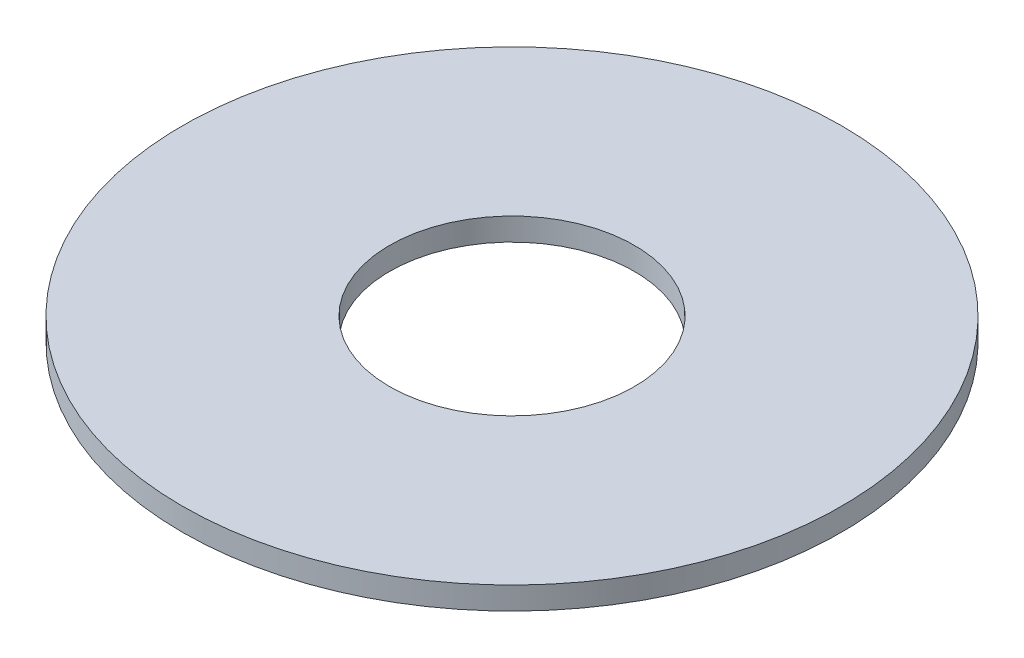
ISO-10303-21;
HEADER;
FILE_DESCRIPTION(('STEP AP214'),'2;1');
FILE_NAME('part.step','',(''),(''),'','','');
FILE_SCHEMA(('AUTOMOTIVE_DESIGN { 1 0 10303 214 1 1 1 1 }'));
ENDSEC;
DATA;
#1=APPLICATION_CONTEXT('core data for automotive mechanical design processes');
#2=APPLICATION_PROTOCOL_DEFINITION('international standard','automotive_design',2000,#1);
#3=PRODUCT_CONTEXT('',#1,'mechanical');
#4=PRODUCT('Part','Part','',(#3));
#5=PRODUCT_RELATED_PRODUCT_CATEGORY('part','',(#4));
#6=PRODUCT_DEFINITION_FORMATION('','',#4);
#7=PRODUCT_DEFINITION_CONTEXT('part definition',#1,'design');
#8=PRODUCT_DEFINITION('design','',#6,#7);
#9=PRODUCT_DEFINITION_SHAPE('','',#8);
#10=(LENGTH_UNIT() NAMED_UNIT(*) SI_UNIT(.MILLI.,.METRE.));
#11=(NAMED_UNIT(*) PLANE_ANGLE_UNIT() SI_UNIT($,.RADIAN.));
#12=(NAMED_UNIT(*) SI_UNIT($,.STERADIAN.) SOLID_ANGLE_UNIT());
#13=UNCERTAINTY_MEASURE_WITH_UNIT(LENGTH_MEASURE(1.E-05),#10,'distance_accuracy_value','');
#14=(GEOMETRIC_REPRESENTATION_CONTEXT(3) GLOBAL_UNCERTAINTY_ASSIGNED_CONTEXT((#13)) GLOBAL_UNIT_ASSIGNED_CONTEXT((#10,
#11,#12)) REPRESENTATION_CONTEXT('',''));
#15=CARTESIAN_POINT('',(0.,0.,0.));
#16=DIRECTION('',(0.,0.,1.));
#17=DIRECTION('',(1.,0.,0.));
#18=AXIS2_PLACEMENT_3D('',#15,#16,#17);
#19=CARTESIAN_POINT('',(0.,6.,0.));
#20=DIRECTION('',(0.,-1.,0.));
#21=DIRECTION('',(0.,0.,-1.));
#22=AXIS2_PLACEMENT_3D('',#19,#20,#21);
#23=CYLINDRICAL_SURFACE('',#22,87.5);
#24=CARTESIAN_POINT('',(0.,6.,0.));
#25=DIRECTION('',(0.,1.,0.));
#26=DIRECTION('',(0.,0.,1.));
#27=AXIS2_PLACEMENT_3D('',#24,#25,#26);
#28=CIRCLE('',#27,87.5);
#29=CARTESIAN_POINT('',(0.,6.,87.5));
#30=VERTEX_POINT('',#29);
#31=EDGE_CURVE('E10',#30,#30,#28,.T.);
#32=ORIENTED_EDGE('',*,*,#31,.F.);
#33=EDGE_LOOP('',(#32));
#34=FACE_BOUND('',#33,.T.);
#35=CARTESIAN_POINT('',(0.,0.,0.));
#36=DIRECTION('',(0.,1.,0.));
#37=DIRECTION('',(0.,0.,1.));
#38=AXIS2_PLACEMENT_3D('',#35,#36,#37);
#39=CIRCLE('',#38,87.5);
#40=CARTESIAN_POINT('',(0.,0.,87.5));
#41=VERTEX_POINT('',#40);
#42=EDGE_CURVE('E37',#41,#41,#39,.T.);
#43=ORIENTED_EDGE('',*,*,#42,.T.);
#44=EDGE_LOOP('',(#43));
#45=FACE_BOUND('',#44,.T.);
#46=ADVANCED_FACE('F40',(#34,#45),#23,.T.);
#47=CARTESIAN_POINT('',(0.,6.,0.));
#48=DIRECTION('',(0.,1.,0.));
#49=DIRECTION('',(0.,0.,1.));
#50=AXIS2_PLACEMENT_3D('',#47,#48,#49);
#51=PLANE('',#50);
#52=CARTESIAN_POINT('',(0.,6.,0.));
#53=DIRECTION('',(0.,1.,0.));
#54=DIRECTION('',(0.,0.,1.));
#55=AXIS2_PLACEMENT_3D('',#52,#53,#54);
#56=CIRCLE('',#55,32.5);
#57=CARTESIAN_POINT('',(0.,6.,32.5));
#58=VERTEX_POINT('',#57);
#59=EDGE_CURVE('E50',#58,#58,#56,.T.);
#60=ORIENTED_EDGE('',*,*,#59,.F.);
#61=EDGE_LOOP('',(#60));
#62=FACE_BOUND('',#61,.T.);
#63=ORIENTED_EDGE('',*,*,#31,.T.);
#64=EDGE_LOOP('',(#63));
#65=FACE_BOUND('',#64,.T.);
#66=ADVANCED_FACE('F59',(#62,#65),#51,.T.);
#67=CARTESIAN_POINT('',(0.,0.,0.));
#68=DIRECTION('',(0.,1.,0.));
#69=DIRECTION('',(0.,0.,1.));
#70=AXIS2_PLACEMENT_3D('',#67,#68,#69);
#71=PLANE('',#70);
#72=CARTESIAN_POINT('',(0.,0.,0.));
#73=DIRECTION('',(0.,1.,0.));
#74=DIRECTION('',(0.,0.,1.));
#75=AXIS2_PLACEMENT_3D('',#72,#73,#74);
#76=CIRCLE('',#75,32.5);
#77=CARTESIAN_POINT('',(0.,0.,32.5));
#78=VERTEX_POINT('',#77);
#79=EDGE_CURVE('E47',#78,#78,#76,.T.);
#80=ORIENTED_EDGE('',*,*,#79,.T.);
#81=EDGE_LOOP('',(#80));
#82=FACE_BOUND('',#81,.T.);
#83=ORIENTED_EDGE('',*,*,#42,.F.);
#84=EDGE_LOOP('',(#83));
#85=FACE_BOUND('',#84,.T.);
#86=ADVANCED_FACE('F58',(#82,#85),#71,.F.);
#87=CARTESIAN_POINT('',(0.,6.,0.));
#88=DIRECTION('',(0.,-1.,0.));
#89=DIRECTION('',(0.,0.,-1.));
#90=AXIS2_PLACEMENT_3D('',#87,#88,#89);
#91=CYLINDRICAL_SURFACE('',#90,32.5);
#92=ORIENTED_EDGE('',*,*,#59,.T.);
#93=EDGE_LOOP('',(#92));
#94=FACE_BOUND('',#93,.T.);
#95=ORIENTED_EDGE('',*,*,#79,.F.);
#96=EDGE_LOOP('',(#95));
#97=FACE_BOUND('',#96,.T.);
#98=ADVANCED_FACE('F54',(#94,#97),#91,.F.);
#99=CLOSED_SHELL('',(#46,#66,#86,#98));
#100=MANIFOLD_SOLID_BREP('B2',#99);
#101=ADVANCED_BREP_SHAPE_REPRESENTATION('',(#18,#100),#14);
#102=SHAPE_DEFINITION_REPRESENTATION(#9,#101);
ENDSEC;
END-ISO-10303-21;
